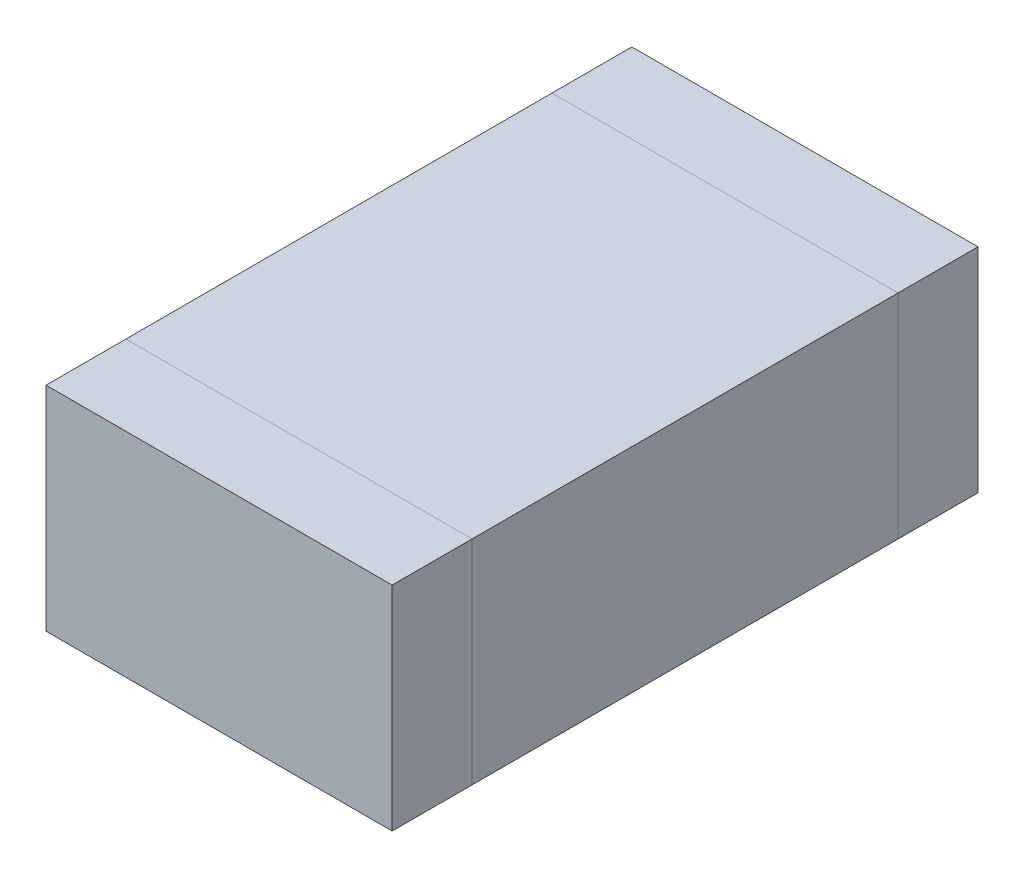
ISO-10303-21;
HEADER;
FILE_DESCRIPTION(('STEP AP214'),'2;1');
FILE_NAME('part.step','',(''),(''),'','','');
FILE_SCHEMA(('AUTOMOTIVE_DESIGN { 1 0 10303 214 1 1 1 1 }'));
ENDSEC;
DATA;
#1=APPLICATION_CONTEXT('core data for automotive mechanical design processes');
#2=APPLICATION_PROTOCOL_DEFINITION('international standard','automotive_design',2000,#1);
#3=PRODUCT_CONTEXT('',#1,'mechanical');
#4=PRODUCT('Part','Part','',(#3));
#5=PRODUCT_RELATED_PRODUCT_CATEGORY('part','',(#4));
#6=PRODUCT_DEFINITION_FORMATION('','',#4);
#7=PRODUCT_DEFINITION_CONTEXT('part definition',#1,'design');
#8=PRODUCT_DEFINITION('design','',#6,#7);
#9=PRODUCT_DEFINITION_SHAPE('','',#8);
#10=(LENGTH_UNIT() NAMED_UNIT(*) SI_UNIT(.MILLI.,.METRE.));
#11=(NAMED_UNIT(*) PLANE_ANGLE_UNIT() SI_UNIT($,.RADIAN.));
#12=(NAMED_UNIT(*) SI_UNIT($,.STERADIAN.) SOLID_ANGLE_UNIT());
#13=UNCERTAINTY_MEASURE_WITH_UNIT(LENGTH_MEASURE(1.E-05),#10,'distance_accuracy_value','');
#14=(GEOMETRIC_REPRESENTATION_CONTEXT(3) GLOBAL_UNCERTAINTY_ASSIGNED_CONTEXT((#13)) GLOBAL_UNIT_ASSIGNED_CONTEXT((#10,
#11,#12)) REPRESENTATION_CONTEXT('',''));
#15=CARTESIAN_POINT('',(0.,0.,0.));
#16=DIRECTION('',(0.,0.,1.));
#17=DIRECTION('',(1.,0.,0.));
#18=AXIS2_PLACEMENT_3D('',#15,#16,#17);
#19=CARTESIAN_POINT('',(0.65,0.8,-1.1));
#20=DIRECTION('',(-1.,0.,0.));
#21=DIRECTION('',(0.,0.,1.));
#22=AXIS2_PLACEMENT_3D('',#19,#20,#21);
#23=PLANE('',#22);
#24=DIRECTION('',(0.,-1.,0.));
#25=VECTOR('',#24,1.);
#26=CARTESIAN_POINT('',(0.65,0.8,-0.8));
#27=LINE('',#26,#25);
#28=CARTESIAN_POINT('',(0.65,0.8,-0.8));
#29=VERTEX_POINT('',#28);
#30=CARTESIAN_POINT('',(0.65,0.,-0.8));
#31=VERTEX_POINT('',#30);
#32=EDGE_CURVE('E109',#29,#31,#27,.T.);
#33=ORIENTED_EDGE('',*,*,#32,.T.);
#34=DIRECTION('',(0.,0.,1.));
#35=VECTOR('',#34,1.);
#36=CARTESIAN_POINT('',(0.65,0.,-1.1));
#37=LINE('',#36,#35);
#38=CARTESIAN_POINT('',(0.65,0.,-1.1));
#39=VERTEX_POINT('',#38);
#40=EDGE_CURVE('E12',#39,#31,#37,.T.);
#41=ORIENTED_EDGE('',*,*,#40,.F.);
#42=DIRECTION('',(0.,-1.,0.));
#43=VECTOR('',#42,1.);
#44=CARTESIAN_POINT('',(0.65,0.8,-1.1));
#45=LINE('',#44,#43);
#46=CARTESIAN_POINT('',(0.65,0.8,-1.1));
#47=VERTEX_POINT('',#46);
#48=EDGE_CURVE('E97',#47,#39,#45,.T.);
#49=ORIENTED_EDGE('',*,*,#48,.F.);
#50=DIRECTION('',(0.,0.,1.));
#51=VECTOR('',#50,1.);
#52=CARTESIAN_POINT('',(0.65,0.8,-1.1));
#53=LINE('',#52,#51);
#54=EDGE_CURVE('E105',#47,#29,#53,.T.);
#55=ORIENTED_EDGE('',*,*,#54,.T.);
#56=EDGE_LOOP('',(#33,#41,#49,#55));
#57=FACE_BOUND('',#56,.T.);
#58=ADVANCED_FACE('F46',(#57),#23,.F.);
#59=CARTESIAN_POINT('',(0.65,0.,-1.1));
#60=DIRECTION('',(0.,1.,0.));
#61=DIRECTION('',(0.,0.,1.));
#62=AXIS2_PLACEMENT_3D('',#59,#60,#61);
#63=PLANE('',#62);
#64=DIRECTION('',(-1.,0.,0.));
#65=VECTOR('',#64,1.);
#66=CARTESIAN_POINT('',(0.65,0.,-0.8));
#67=LINE('',#66,#65);
#68=CARTESIAN_POINT('',(-0.65,0.,-0.8));
#69=VERTEX_POINT('',#68);
#70=EDGE_CURVE('E101',#31,#69,#67,.T.);
#71=ORIENTED_EDGE('',*,*,#70,.T.);
#72=DIRECTION('',(0.,0.,1.));
#73=VECTOR('',#72,1.);
#74=CARTESIAN_POINT('',(-0.65,0.,-1.1));
#75=LINE('',#74,#73);
#76=CARTESIAN_POINT('',(-0.65,0.,-1.1));
#77=VERTEX_POINT('',#76);
#78=EDGE_CURVE('E54',#77,#69,#75,.T.);
#79=ORIENTED_EDGE('',*,*,#78,.F.);
#80=DIRECTION('',(-1.,0.,0.));
#81=VECTOR('',#80,1.);
#82=CARTESIAN_POINT('',(0.65,0.,-1.1));
#83=LINE('',#82,#81);
#84=EDGE_CURVE('E92',#39,#77,#83,.T.);
#85=ORIENTED_EDGE('',*,*,#84,.F.);
#86=ORIENTED_EDGE('',*,*,#40,.T.);
#87=EDGE_LOOP('',(#71,#79,#85,#86));
#88=FACE_BOUND('',#87,.T.);
#89=ADVANCED_FACE('F100',(#88),#63,.F.);
#90=CARTESIAN_POINT('',(-0.65,0.,-1.1));
#91=DIRECTION('',(1.,0.,0.));
#92=DIRECTION('',(0.,0.,-1.));
#93=AXIS2_PLACEMENT_3D('',#90,#91,#92);
#94=PLANE('',#93);
#95=DIRECTION('',(0.,1.,0.));
#96=VECTOR('',#95,1.);
#97=CARTESIAN_POINT('',(-0.65,0.,-0.8));
#98=LINE('',#97,#96);
#99=CARTESIAN_POINT('',(-0.65,0.8,-0.8));
#100=VERTEX_POINT('',#99);
#101=EDGE_CURVE('E79',#69,#100,#98,.T.);
#102=ORIENTED_EDGE('',*,*,#101,.T.);
#103=DIRECTION('',(0.,0.,1.));
#104=VECTOR('',#103,1.);
#105=CARTESIAN_POINT('',(-0.65,0.8,-1.1));
#106=LINE('',#105,#104);
#107=CARTESIAN_POINT('',(-0.65,0.8,-1.1));
#108=VERTEX_POINT('',#107);
#109=EDGE_CURVE('E102',#108,#100,#106,.T.);
#110=ORIENTED_EDGE('',*,*,#109,.F.);
#111=DIRECTION('',(0.,1.,0.));
#112=VECTOR('',#111,1.);
#113=CARTESIAN_POINT('',(-0.65,0.,-1.1));
#114=LINE('',#113,#112);
#115=EDGE_CURVE('E95',#77,#108,#114,.T.);
#116=ORIENTED_EDGE('',*,*,#115,.F.);
#117=ORIENTED_EDGE('',*,*,#78,.T.);
#118=EDGE_LOOP('',(#102,#110,#116,#117));
#119=FACE_BOUND('',#118,.T.);
#120=ADVANCED_FACE('F103',(#119),#94,.F.);
#121=CARTESIAN_POINT('',(-0.65,0.8,-1.1));
#122=DIRECTION('',(0.,-1.,0.));
#123=DIRECTION('',(0.,0.,-1.));
#124=AXIS2_PLACEMENT_3D('',#121,#122,#123);
#125=PLANE('',#124);
#126=DIRECTION('',(1.,0.,0.));
#127=VECTOR('',#126,1.);
#128=CARTESIAN_POINT('',(-0.65,0.8,-0.8));
#129=LINE('',#128,#127);
#130=EDGE_CURVE('E85',#100,#29,#129,.T.);
#131=ORIENTED_EDGE('',*,*,#130,.T.);
#132=ORIENTED_EDGE('',*,*,#54,.F.);
#133=DIRECTION('',(1.,0.,0.));
#134=VECTOR('',#133,1.);
#135=CARTESIAN_POINT('',(-0.65,0.8,-1.1));
#136=LINE('',#135,#134);
#137=EDGE_CURVE('E62',#108,#47,#136,.T.);
#138=ORIENTED_EDGE('',*,*,#137,.F.);
#139=ORIENTED_EDGE('',*,*,#109,.T.);
#140=EDGE_LOOP('',(#131,#132,#138,#139));
#141=FACE_BOUND('',#140,.T.);
#142=ADVANCED_FACE('F116',(#141),#125,.F.);
#143=CARTESIAN_POINT('',(0.,0.,-1.1));
#144=DIRECTION('',(0.,0.,-1.));
#145=DIRECTION('',(-1.,0.,0.));
#146=AXIS2_PLACEMENT_3D('',#143,#144,#145);
#147=PLANE('',#146);
#148=ORIENTED_EDGE('',*,*,#48,.T.);
#149=ORIENTED_EDGE('',*,*,#84,.T.);
#150=ORIENTED_EDGE('',*,*,#115,.T.);
#151=ORIENTED_EDGE('',*,*,#137,.T.);
#152=EDGE_LOOP('',(#148,#149,#150,#151));
#153=FACE_BOUND('',#152,.T.);
#154=ADVANCED_FACE('F93',(#153),#147,.T.);
#155=CARTESIAN_POINT('',(0.,0.,-0.8));
#156=DIRECTION('',(0.,0.,-1.));
#157=DIRECTION('',(-1.,0.,0.));
#158=AXIS2_PLACEMENT_3D('',#155,#156,#157);
#159=PLANE('',#158);
#160=ORIENTED_EDGE('',*,*,#32,.F.);
#161=ORIENTED_EDGE('',*,*,#130,.F.);
#162=ORIENTED_EDGE('',*,*,#101,.F.);
#163=ORIENTED_EDGE('',*,*,#70,.F.);
#164=EDGE_LOOP('',(#160,#161,#162,#163));
#165=FACE_BOUND('',#164,.T.);
#166=ADVANCED_FACE('F119',(#165),#159,.F.);
#167=CLOSED_SHELL('',(#58,#89,#120,#142,#154,#166));
#168=MANIFOLD_SOLID_BREP('B2',#167);
#169=CARTESIAN_POINT('',(-0.65,0.8,1.1));
#170=DIRECTION('',(1.,0.,0.));
#171=DIRECTION('',(0.,0.,-1.));
#172=AXIS2_PLACEMENT_3D('',#169,#170,#171);
#173=PLANE('',#172);
#174=DIRECTION('',(0.,-1.,0.));
#175=VECTOR('',#174,1.);
#176=CARTESIAN_POINT('',(-0.65,0.8,0.8));
#177=LINE('',#176,#175);
#178=CARTESIAN_POINT('',(-0.65,0.8,0.8));
#179=VERTEX_POINT('',#178);
#180=CARTESIAN_POINT('',(-0.65,0.,0.8));
#181=VERTEX_POINT('',#180);
#182=EDGE_CURVE('E242',#179,#181,#177,.T.);
#183=ORIENTED_EDGE('',*,*,#182,.T.);
#184=DIRECTION('',(0.,0.,-1.));
#185=VECTOR('',#184,1.);
#186=CARTESIAN_POINT('',(-0.65,0.,1.1));
#187=LINE('',#186,#185);
#188=CARTESIAN_POINT('',(-0.65,0.,1.1));
#189=VERTEX_POINT('',#188);
#190=EDGE_CURVE('E44',#189,#181,#187,.T.);
#191=ORIENTED_EDGE('',*,*,#190,.F.);
#192=DIRECTION('',(0.,-1.,0.));
#193=VECTOR('',#192,1.);
#194=CARTESIAN_POINT('',(-0.65,0.8,1.1));
#195=LINE('',#194,#193);
#196=CARTESIAN_POINT('',(-0.65,0.8,1.1));
#197=VERTEX_POINT('',#196);
#198=EDGE_CURVE('E230',#197,#189,#195,.T.);
#199=ORIENTED_EDGE('',*,*,#198,.F.);
#200=DIRECTION('',(0.,0.,-1.));
#201=VECTOR('',#200,1.);
#202=CARTESIAN_POINT('',(-0.65,0.8,1.1));
#203=LINE('',#202,#201);
#204=EDGE_CURVE('E238',#197,#179,#203,.T.);
#205=ORIENTED_EDGE('',*,*,#204,.T.);
#206=EDGE_LOOP('',(#183,#191,#199,#205));
#207=FACE_BOUND('',#206,.T.);
#208=ADVANCED_FACE('F179',(#207),#173,.F.);
#209=CARTESIAN_POINT('',(-0.65,0.,1.1));
#210=DIRECTION('',(0.,1.,0.));
#211=DIRECTION('',(0.,0.,1.));
#212=AXIS2_PLACEMENT_3D('',#209,#210,#211);
#213=PLANE('',#212);
#214=DIRECTION('',(1.,0.,0.));
#215=VECTOR('',#214,1.);
#216=CARTESIAN_POINT('',(-0.65,0.,0.8));
#217=LINE('',#216,#215);
#218=CARTESIAN_POINT('',(0.65,0.,0.8));
#219=VERTEX_POINT('',#218);
#220=EDGE_CURVE('E234',#181,#219,#217,.T.);
#221=ORIENTED_EDGE('',*,*,#220,.T.);
#222=DIRECTION('',(0.,0.,-1.));
#223=VECTOR('',#222,1.);
#224=CARTESIAN_POINT('',(0.65,0.,1.1));
#225=LINE('',#224,#223);
#226=CARTESIAN_POINT('',(0.65,0.,1.1));
#227=VERTEX_POINT('',#226);
#228=EDGE_CURVE('E187',#227,#219,#225,.T.);
#229=ORIENTED_EDGE('',*,*,#228,.F.);
#230=DIRECTION('',(1.,0.,0.));
#231=VECTOR('',#230,1.);
#232=CARTESIAN_POINT('',(-0.65,0.,1.1));
#233=LINE('',#232,#231);
#234=EDGE_CURVE('E225',#189,#227,#233,.T.);
#235=ORIENTED_EDGE('',*,*,#234,.F.);
#236=ORIENTED_EDGE('',*,*,#190,.T.);
#237=EDGE_LOOP('',(#221,#229,#235,#236));
#238=FACE_BOUND('',#237,.T.);
#239=ADVANCED_FACE('F233',(#238),#213,.F.);
#240=CARTESIAN_POINT('',(0.65,0.,1.1));
#241=DIRECTION('',(-1.,0.,0.));
#242=DIRECTION('',(0.,0.,1.));
#243=AXIS2_PLACEMENT_3D('',#240,#241,#242);
#244=PLANE('',#243);
#245=DIRECTION('',(0.,1.,0.));
#246=VECTOR('',#245,1.);
#247=CARTESIAN_POINT('',(0.65,0.,0.8));
#248=LINE('',#247,#246);
#249=CARTESIAN_POINT('',(0.65,0.8,0.8));
#250=VERTEX_POINT('',#249);
#251=EDGE_CURVE('E212',#219,#250,#248,.T.);
#252=ORIENTED_EDGE('',*,*,#251,.T.);
#253=DIRECTION('',(0.,0.,-1.));
#254=VECTOR('',#253,1.);
#255=CARTESIAN_POINT('',(0.65,0.8,1.1));
#256=LINE('',#255,#254);
#257=CARTESIAN_POINT('',(0.65,0.8,1.1));
#258=VERTEX_POINT('',#257);
#259=EDGE_CURVE('E235',#258,#250,#256,.T.);
#260=ORIENTED_EDGE('',*,*,#259,.F.);
#261=DIRECTION('',(0.,1.,0.));
#262=VECTOR('',#261,1.);
#263=CARTESIAN_POINT('',(0.65,0.,1.1));
#264=LINE('',#263,#262);
#265=EDGE_CURVE('E228',#227,#258,#264,.T.);
#266=ORIENTED_EDGE('',*,*,#265,.F.);
#267=ORIENTED_EDGE('',*,*,#228,.T.);
#268=EDGE_LOOP('',(#252,#260,#266,#267));
#269=FACE_BOUND('',#268,.T.);
#270=ADVANCED_FACE('F236',(#269),#244,.F.);
#271=CARTESIAN_POINT('',(0.65,0.8,1.1));
#272=DIRECTION('',(0.,-1.,0.));
#273=DIRECTION('',(0.,0.,-1.));
#274=AXIS2_PLACEMENT_3D('',#271,#272,#273);
#275=PLANE('',#274);
#276=DIRECTION('',(-1.,0.,0.));
#277=VECTOR('',#276,1.);
#278=CARTESIAN_POINT('',(0.65,0.8,0.8));
#279=LINE('',#278,#277);
#280=EDGE_CURVE('E218',#250,#179,#279,.T.);
#281=ORIENTED_EDGE('',*,*,#280,.T.);
#282=ORIENTED_EDGE('',*,*,#204,.F.);
#283=DIRECTION('',(-1.,0.,0.));
#284=VECTOR('',#283,1.);
#285=CARTESIAN_POINT('',(0.65,0.8,1.1));
#286=LINE('',#285,#284);
#287=EDGE_CURVE('E195',#258,#197,#286,.T.);
#288=ORIENTED_EDGE('',*,*,#287,.F.);
#289=ORIENTED_EDGE('',*,*,#259,.T.);
#290=EDGE_LOOP('',(#281,#282,#288,#289));
#291=FACE_BOUND('',#290,.T.);
#292=ADVANCED_FACE('F249',(#291),#275,.F.);
#293=CARTESIAN_POINT('',(0.,0.,1.1));
#294=DIRECTION('',(0.,0.,1.));
#295=DIRECTION('',(1.,0.,0.));
#296=AXIS2_PLACEMENT_3D('',#293,#294,#295);
#297=PLANE('',#296);
#298=ORIENTED_EDGE('',*,*,#198,.T.);
#299=ORIENTED_EDGE('',*,*,#234,.T.);
#300=ORIENTED_EDGE('',*,*,#265,.T.);
#301=ORIENTED_EDGE('',*,*,#287,.T.);
#302=EDGE_LOOP('',(#298,#299,#300,#301));
#303=FACE_BOUND('',#302,.T.);
#304=ADVANCED_FACE('F226',(#303),#297,.T.);
#305=CARTESIAN_POINT('',(0.,0.,0.8));
#306=DIRECTION('',(0.,0.,1.));
#307=DIRECTION('',(1.,0.,0.));
#308=AXIS2_PLACEMENT_3D('',#305,#306,#307);
#309=PLANE('',#308);
#310=ORIENTED_EDGE('',*,*,#182,.F.);
#311=ORIENTED_EDGE('',*,*,#280,.F.);
#312=ORIENTED_EDGE('',*,*,#251,.F.);
#313=ORIENTED_EDGE('',*,*,#220,.F.);
#314=EDGE_LOOP('',(#310,#311,#312,#313));
#315=FACE_BOUND('',#314,.T.);
#316=ADVANCED_FACE('F252',(#315),#309,.F.);
#317=CLOSED_SHELL('',(#208,#239,#270,#292,#304,#316));
#318=MANIFOLD_SOLID_BREP('B6',#317);
#319=CARTESIAN_POINT('',(0.65,0.8,-0.8));
#320=DIRECTION('',(-1.,0.,0.));
#321=DIRECTION('',(0.,0.,1.));
#322=AXIS2_PLACEMENT_3D('',#319,#320,#321);
#323=PLANE('',#322);
#324=DIRECTION('',(0.,0.,-1.));
#325=VECTOR('',#324,1.);
#326=CARTESIAN_POINT('',(0.65,0.,-0.8));
#327=LINE('',#326,#325);
#328=CARTESIAN_POINT('',(0.65,0.,0.8));
#329=VERTEX_POINT('',#328);
#330=CARTESIAN_POINT('',(0.65,0.,-0.8));
#331=VERTEX_POINT('',#330);
#332=EDGE_CURVE('E366',#329,#331,#327,.T.);
#333=ORIENTED_EDGE('',*,*,#332,.T.);
#334=DIRECTION('',(0.,-1.,0.));
#335=VECTOR('',#334,1.);
#336=CARTESIAN_POINT('',(0.65,0.8,-0.8));
#337=LINE('',#336,#335);
#338=CARTESIAN_POINT('',(0.65,0.8,-0.8));
#339=VERTEX_POINT('',#338);
#340=EDGE_CURVE('E177',#339,#331,#337,.T.);
#341=ORIENTED_EDGE('',*,*,#340,.F.);
#342=DIRECTION('',(0.,0.,-1.));
#343=VECTOR('',#342,1.);
#344=CARTESIAN_POINT('',(0.65,0.8,-0.8));
#345=LINE('',#344,#343);
#346=CARTESIAN_POINT('',(0.65,0.8,0.8));
#347=VERTEX_POINT('',#346);
#348=EDGE_CURVE('E354',#347,#339,#345,.T.);
#349=ORIENTED_EDGE('',*,*,#348,.F.);
#350=DIRECTION('',(0.,-1.,0.));
#351=VECTOR('',#350,1.);
#352=CARTESIAN_POINT('',(0.65,0.8,0.8));
#353=LINE('',#352,#351);
#354=EDGE_CURVE('E362',#347,#329,#353,.T.);
#355=ORIENTED_EDGE('',*,*,#354,.T.);
#356=EDGE_LOOP('',(#333,#341,#349,#355));
#357=FACE_BOUND('',#356,.T.);
#358=ADVANCED_FACE('F303',(#357),#323,.F.);
#359=CARTESIAN_POINT('',(-0.65,0.8,-0.8));
#360=DIRECTION('',(0.,0.,1.));
#361=DIRECTION('',(1.,0.,0.));
#362=AXIS2_PLACEMENT_3D('',#359,#360,#361);
#363=PLANE('',#362);
#364=DIRECTION('',(-1.,0.,0.));
#365=VECTOR('',#364,1.);
#366=CARTESIAN_POINT('',(-0.65,0.,-0.8));
#367=LINE('',#366,#365);
#368=CARTESIAN_POINT('',(-0.65,0.,-0.8));
#369=VERTEX_POINT('',#368);
#370=EDGE_CURVE('E358',#331,#369,#367,.T.);
#371=ORIENTED_EDGE('',*,*,#370,.T.);
#372=DIRECTION('',(0.,-1.,0.));
#373=VECTOR('',#372,1.);
#374=CARTESIAN_POINT('',(-0.65,0.8,-0.8));
#375=LINE('',#374,#373);
#376=CARTESIAN_POINT('',(-0.65,0.8,-0.8));
#377=VERTEX_POINT('',#376);
#378=EDGE_CURVE('E311',#377,#369,#375,.T.);
#379=ORIENTED_EDGE('',*,*,#378,.F.);
#380=DIRECTION('',(-1.,0.,0.));
#381=VECTOR('',#380,1.);
#382=CARTESIAN_POINT('',(-0.65,0.8,-0.8));
#383=LINE('',#382,#381);
#384=EDGE_CURVE('E349',#339,#377,#383,.T.);
#385=ORIENTED_EDGE('',*,*,#384,.F.);
#386=ORIENTED_EDGE('',*,*,#340,.T.);
#387=EDGE_LOOP('',(#371,#379,#385,#386));
#388=FACE_BOUND('',#387,.T.);
#389=ADVANCED_FACE('F357',(#388),#363,.F.);
#390=CARTESIAN_POINT('',(-0.65,0.8,-0.8));
#391=DIRECTION('',(1.,0.,0.));
#392=DIRECTION('',(0.,0.,-1.));
#393=AXIS2_PLACEMENT_3D('',#390,#391,#392);
#394=PLANE('',#393);
#395=DIRECTION('',(0.,0.,1.));
#396=VECTOR('',#395,1.);
#397=CARTESIAN_POINT('',(-0.65,0.,-0.8));
#398=LINE('',#397,#396);
#399=CARTESIAN_POINT('',(-0.65,0.,0.8));
#400=VERTEX_POINT('',#399);
#401=EDGE_CURVE('E336',#369,#400,#398,.T.);
#402=ORIENTED_EDGE('',*,*,#401,.T.);
#403=DIRECTION('',(0.,-1.,0.));
#404=VECTOR('',#403,1.);
#405=CARTESIAN_POINT('',(-0.65,0.8,0.8));
#406=LINE('',#405,#404);
#407=CARTESIAN_POINT('',(-0.65,0.8,0.8));
#408=VERTEX_POINT('',#407);
#409=EDGE_CURVE('E359',#408,#400,#406,.T.);
#410=ORIENTED_EDGE('',*,*,#409,.F.);
#411=DIRECTION('',(0.,0.,1.));
#412=VECTOR('',#411,1.);
#413=CARTESIAN_POINT('',(-0.65,0.8,-0.8));
#414=LINE('',#413,#412);
#415=EDGE_CURVE('E352',#377,#408,#414,.T.);
#416=ORIENTED_EDGE('',*,*,#415,.F.);
#417=ORIENTED_EDGE('',*,*,#378,.T.);
#418=EDGE_LOOP('',(#402,#410,#416,#417));
#419=FACE_BOUND('',#418,.T.);
#420=ADVANCED_FACE('F360',(#419),#394,.F.);
#421=CARTESIAN_POINT('',(-0.65,0.8,0.8));
#422=DIRECTION('',(0.,0.,-1.));
#423=DIRECTION('',(-1.,0.,0.));
#424=AXIS2_PLACEMENT_3D('',#421,#422,#423);
#425=PLANE('',#424);
#426=DIRECTION('',(1.,0.,0.));
#427=VECTOR('',#426,1.);
#428=CARTESIAN_POINT('',(-0.65,0.,0.8));
#429=LINE('',#428,#427);
#430=EDGE_CURVE('E342',#400,#329,#429,.T.);
#431=ORIENTED_EDGE('',*,*,#430,.T.);
#432=ORIENTED_EDGE('',*,*,#354,.F.);
#433=DIRECTION('',(1.,0.,0.));
#434=VECTOR('',#433,1.);
#435=CARTESIAN_POINT('',(-0.65,0.8,0.8));
#436=LINE('',#435,#434);
#437=EDGE_CURVE('E319',#408,#347,#436,.T.);
#438=ORIENTED_EDGE('',*,*,#437,.F.);
#439=ORIENTED_EDGE('',*,*,#409,.T.);
#440=EDGE_LOOP('',(#431,#432,#438,#439));
#441=FACE_BOUND('',#440,.T.);
#442=ADVANCED_FACE('F373',(#441),#425,.F.);
#443=CARTESIAN_POINT('',(0.,0.8,0.));
#444=DIRECTION('',(0.,1.,0.));
#445=DIRECTION('',(0.,0.,1.));
#446=AXIS2_PLACEMENT_3D('',#443,#444,#445);
#447=PLANE('',#446);
#448=ORIENTED_EDGE('',*,*,#348,.T.);
#449=ORIENTED_EDGE('',*,*,#384,.T.);
#450=ORIENTED_EDGE('',*,*,#415,.T.);
#451=ORIENTED_EDGE('',*,*,#437,.T.);
#452=EDGE_LOOP('',(#448,#449,#450,#451));
#453=FACE_BOUND('',#452,.T.);
#454=ADVANCED_FACE('F350',(#453),#447,.T.);
#455=CARTESIAN_POINT('',(0.,0.,0.));
#456=DIRECTION('',(0.,1.,0.));
#457=DIRECTION('',(0.,0.,1.));
#458=AXIS2_PLACEMENT_3D('',#455,#456,#457);
#459=PLANE('',#458);
#460=ORIENTED_EDGE('',*,*,#332,.F.);
#461=ORIENTED_EDGE('',*,*,#430,.F.);
#462=ORIENTED_EDGE('',*,*,#401,.F.);
#463=ORIENTED_EDGE('',*,*,#370,.F.);
#464=EDGE_LOOP('',(#460,#461,#462,#463));
#465=FACE_BOUND('',#464,.T.);
#466=ADVANCED_FACE('F376',(#465),#459,.F.);
#467=CLOSED_SHELL('',(#358,#389,#420,#442,#454,#466));
#468=MANIFOLD_SOLID_BREP('B38',#467);
#469=ADVANCED_BREP_SHAPE_REPRESENTATION('',(#18,#168,#318,#468),#14);
#470=SHAPE_DEFINITION_REPRESENTATION(#9,#469);
ENDSEC;
END-ISO-10303-21;
